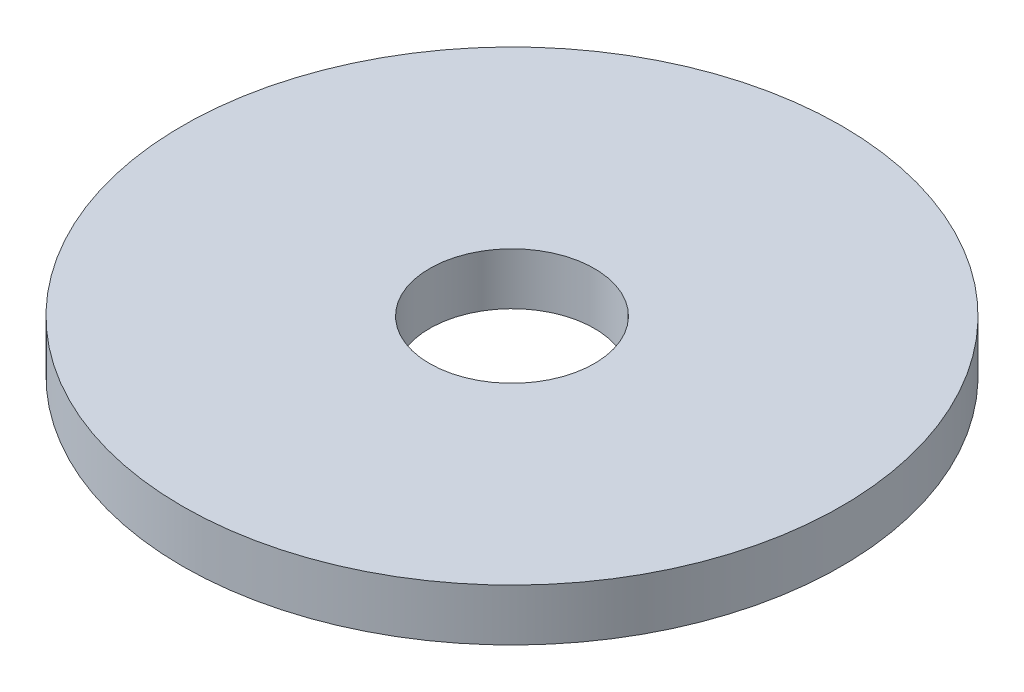
ISO-10303-21;
HEADER;
FILE_DESCRIPTION(('STEP AP214'),'2;1');
FILE_NAME('part.step','',(''),(''),'','','');
FILE_SCHEMA(('AUTOMOTIVE_DESIGN { 1 0 10303 214 1 1 1 1 }'));
ENDSEC;
DATA;
#1=APPLICATION_CONTEXT('core data for automotive mechanical design processes');
#2=APPLICATION_PROTOCOL_DEFINITION('international standard','automotive_design',2000,#1);
#3=PRODUCT_CONTEXT('',#1,'mechanical');
#4=PRODUCT('Part','Part','',(#3));
#5=PRODUCT_RELATED_PRODUCT_CATEGORY('part','',(#4));
#6=PRODUCT_DEFINITION_FORMATION('','',#4);
#7=PRODUCT_DEFINITION_CONTEXT('part definition',#1,'design');
#8=PRODUCT_DEFINITION('design','',#6,#7);
#9=PRODUCT_DEFINITION_SHAPE('','',#8);
#10=(LENGTH_UNIT() NAMED_UNIT(*) SI_UNIT(.MILLI.,.METRE.));
#11=(NAMED_UNIT(*) PLANE_ANGLE_UNIT() SI_UNIT($,.RADIAN.));
#12=(NAMED_UNIT(*) SI_UNIT($,.STERADIAN.) SOLID_ANGLE_UNIT());
#13=UNCERTAINTY_MEASURE_WITH_UNIT(LENGTH_MEASURE(1.E-05),#10,'distance_accuracy_value','');
#14=(GEOMETRIC_REPRESENTATION_CONTEXT(3) GLOBAL_UNCERTAINTY_ASSIGNED_CONTEXT((#13)) GLOBAL_UNIT_ASSIGNED_CONTEXT((#10,
#11,#12)) REPRESENTATION_CONTEXT('',''));
#15=CARTESIAN_POINT('',(0.,0.,0.));
#16=DIRECTION('',(0.,0.,1.));
#17=DIRECTION('',(1.,0.,0.));
#18=AXIS2_PLACEMENT_3D('',#15,#16,#17);
#19=CARTESIAN_POINT('',(0.,299.544827586207,0.));
#20=DIRECTION('',(0.,1.,0.));
#21=DIRECTION('',(0.,0.,1.));
#22=AXIS2_PLACEMENT_3D('',#19,#20,#21);
#23=CYLINDRICAL_SURFACE('',#22,9.52499999999996);
#24=CARTESIAN_POINT('',(0.,-1.5,0.));
#25=DIRECTION('',(0.,1.,0.));
#26=DIRECTION('',(0.,0.,1.));
#27=AXIS2_PLACEMENT_3D('',#24,#25,#26);
#28=CIRCLE('',#27,9.52499999999996);
#29=CARTESIAN_POINT('',(0.,-1.5,9.52499999999996));
#30=VERTEX_POINT('',#29);
#31=EDGE_CURVE('E10',#30,#30,#28,.T.);
#32=ORIENTED_EDGE('',*,*,#31,.T.);
#33=EDGE_LOOP('',(#32));
#34=FACE_BOUND('',#33,.T.);
#35=CARTESIAN_POINT('',(0.,0.,0.));
#36=DIRECTION('',(0.,1.,0.));
#37=DIRECTION('',(0.,0.,1.));
#38=AXIS2_PLACEMENT_3D('',#35,#36,#37);
#39=CIRCLE('',#38,9.52499999999996);
#40=CARTESIAN_POINT('',(0.,0.,9.52499999999996));
#41=VERTEX_POINT('',#40);
#42=EDGE_CURVE('E54',#41,#41,#39,.T.);
#43=ORIENTED_EDGE('',*,*,#42,.F.);
#44=EDGE_LOOP('',(#43));
#45=FACE_BOUND('',#44,.T.);
#46=ADVANCED_FACE('F37',(#34,#45),#23,.T.);
#47=CARTESIAN_POINT('',(-9.52499999999996,-1.5,0.));
#48=DIRECTION('',(0.,-1.,0.));
#49=DIRECTION('',(0.,0.,-1.));
#50=AXIS2_PLACEMENT_3D('',#47,#48,#49);
#51=PLANE('',#50);
#52=CARTESIAN_POINT('',(0.,-1.5,0.));
#53=DIRECTION('',(0.,1.,0.));
#54=DIRECTION('',(0.,0.,1.));
#55=AXIS2_PLACEMENT_3D('',#52,#53,#54);
#56=CIRCLE('',#55,2.38124999999996);
#57=CARTESIAN_POINT('',(0.,-1.5,2.38124999999996));
#58=VERTEX_POINT('',#57);
#59=EDGE_CURVE('E44',#58,#58,#56,.T.);
#60=ORIENTED_EDGE('',*,*,#59,.T.);
#61=EDGE_LOOP('',(#60));
#62=FACE_BOUND('',#61,.T.);
#63=ORIENTED_EDGE('',*,*,#31,.F.);
#64=EDGE_LOOP('',(#63));
#65=FACE_BOUND('',#64,.T.);
#66=ADVANCED_FACE('F65',(#62,#65),#51,.T.);
#67=CARTESIAN_POINT('',(0.,299.544827586207,0.));
#68=DIRECTION('',(0.,1.,0.));
#69=DIRECTION('',(0.,0.,1.));
#70=AXIS2_PLACEMENT_3D('',#67,#68,#69);
#71=CYLINDRICAL_SURFACE('',#70,2.38124999999996);
#72=CARTESIAN_POINT('',(0.,0.,0.));
#73=DIRECTION('',(0.,1.,0.));
#74=DIRECTION('',(0.,0.,1.));
#75=AXIS2_PLACEMENT_3D('',#72,#73,#74);
#76=CIRCLE('',#75,2.38124999999996);
#77=CARTESIAN_POINT('',(0.,0.,2.38124999999996));
#78=VERTEX_POINT('',#77);
#79=EDGE_CURVE('E49',#78,#78,#76,.T.);
#80=ORIENTED_EDGE('',*,*,#79,.T.);
#81=EDGE_LOOP('',(#80));
#82=FACE_BOUND('',#81,.T.);
#83=ORIENTED_EDGE('',*,*,#59,.F.);
#84=EDGE_LOOP('',(#83));
#85=FACE_BOUND('',#84,.T.);
#86=ADVANCED_FACE('F69',(#82,#85),#71,.F.);
#87=CARTESIAN_POINT('',(-2.38124999999996,0.,0.));
#88=DIRECTION('',(0.,1.,0.));
#89=DIRECTION('',(0.,0.,1.));
#90=AXIS2_PLACEMENT_3D('',#87,#88,#89);
#91=PLANE('',#90);
#92=ORIENTED_EDGE('',*,*,#42,.T.);
#93=EDGE_LOOP('',(#92));
#94=FACE_BOUND('',#93,.T.);
#95=ORIENTED_EDGE('',*,*,#79,.F.);
#96=EDGE_LOOP('',(#95));
#97=FACE_BOUND('',#96,.T.);
#98=ADVANCED_FACE('F61',(#94,#97),#91,.T.);
#99=CLOSED_SHELL('',(#46,#66,#86,#98));
#100=MANIFOLD_SOLID_BREP('B2',#99);
#101=ADVANCED_BREP_SHAPE_REPRESENTATION('',(#18,#100),#14);
#102=SHAPE_DEFINITION_REPRESENTATION(#9,#101);
ENDSEC;
END-ISO-10303-21;
